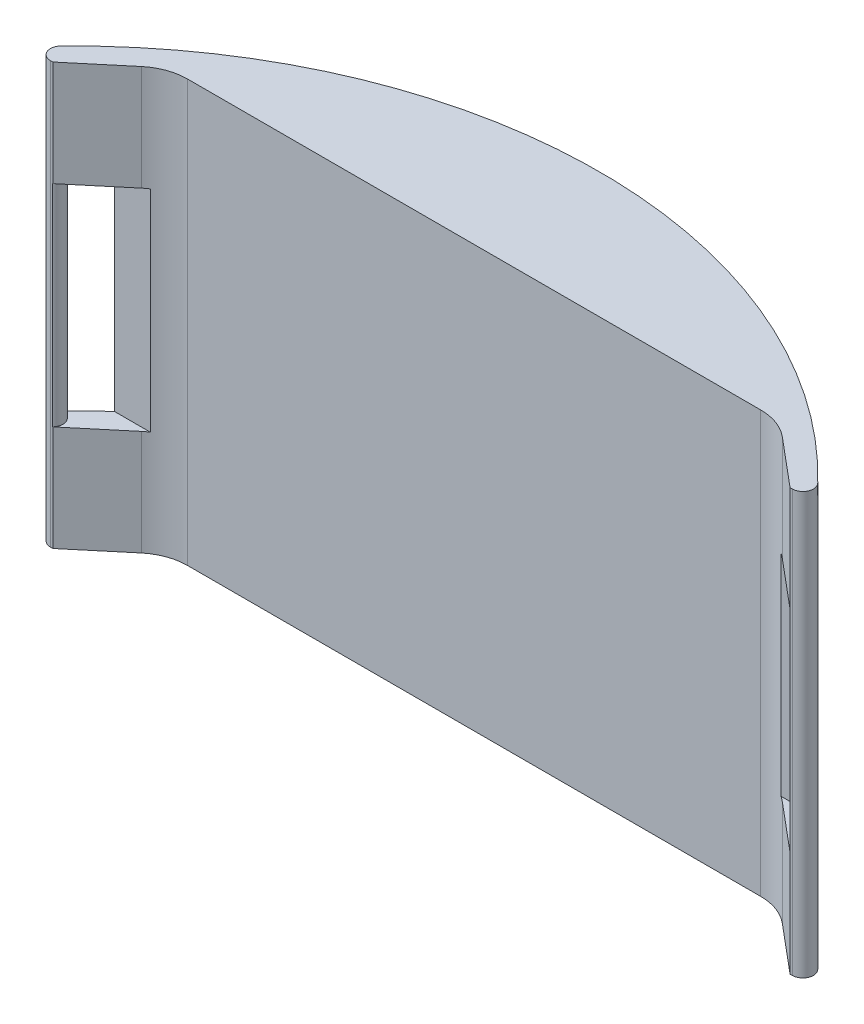
ISO-10303-21;
HEADER;
FILE_DESCRIPTION(('STEP AP214'),'2;1');
FILE_NAME('part.step','',(''),(''),'','','');
FILE_SCHEMA(('AUTOMOTIVE_DESIGN { 1 0 10303 214 1 1 1 1 }'));
ENDSEC;
DATA;
#1=APPLICATION_CONTEXT('core data for automotive mechanical design processes');
#2=APPLICATION_PROTOCOL_DEFINITION('international standard','automotive_design',2000,#1);
#3=PRODUCT_CONTEXT('',#1,'mechanical');
#4=PRODUCT('Part','Part','',(#3));
#5=PRODUCT_RELATED_PRODUCT_CATEGORY('part','',(#4));
#6=PRODUCT_DEFINITION_FORMATION('','',#4);
#7=PRODUCT_DEFINITION_CONTEXT('part definition',#1,'design');
#8=PRODUCT_DEFINITION('design','',#6,#7);
#9=PRODUCT_DEFINITION_SHAPE('','',#8);
#10=(LENGTH_UNIT() NAMED_UNIT(*) SI_UNIT(.MILLI.,.METRE.));
#11=(NAMED_UNIT(*) PLANE_ANGLE_UNIT() SI_UNIT($,.RADIAN.));
#12=(NAMED_UNIT(*) SI_UNIT($,.STERADIAN.) SOLID_ANGLE_UNIT());
#13=UNCERTAINTY_MEASURE_WITH_UNIT(LENGTH_MEASURE(1.E-05),#10,'distance_accuracy_value','');
#14=(GEOMETRIC_REPRESENTATION_CONTEXT(3) GLOBAL_UNCERTAINTY_ASSIGNED_CONTEXT((#13)) GLOBAL_UNIT_ASSIGNED_CONTEXT((#10,
#11,#12)) REPRESENTATION_CONTEXT('',''));
#15=CARTESIAN_POINT('',(0.,0.,0.));
#16=DIRECTION('',(0.,0.,1.));
#17=DIRECTION('',(1.,0.,0.));
#18=AXIS2_PLACEMENT_3D('',#15,#16,#17);
#19=CARTESIAN_POINT('',(86.5691753437898,0.,54.9576637500718));
#20=DIRECTION('',(0.642281467934558,0.,-0.766468861694869));
#21=DIRECTION('',(-0.766468861694869,0.,-0.642281467934558));
#22=AXIS2_PLACEMENT_3D('',#19,#20,#21);
#23=PLANE('',#22);
#24=DIRECTION('',(0.,1.,0.));
#25=VECTOR('',#24,1.);
#26=CARTESIAN_POINT('',(86.5691753437898,0.,54.9576637500718));
#27=LINE('',#26,#25);
#28=CARTESIAN_POINT('',(86.5691753437898,0.,54.9576637500718));
#29=VERTEX_POINT('',#28);
#30=CARTESIAN_POINT('',(86.5691753437898,20.,54.9576637500718));
#31=VERTEX_POINT('',#30);
#32=EDGE_CURVE('E399',#29,#31,#27,.T.);
#33=ORIENTED_EDGE('',*,*,#32,.T.);
#34=DIRECTION('',(-0.766468861694869,0.,-0.642281467934559));
#35=VECTOR('',#34,1.);
#36=CARTESIAN_POINT('',(86.5691753437898,20.,54.9576637500718));
#37=LINE('',#36,#35);
#38=CARTESIAN_POINT('',(77.4224920705355,20.,47.2929751331231));
#39=VERTEX_POINT('',#38);
#40=EDGE_CURVE('E304',#31,#39,#37,.T.);
#41=ORIENTED_EDGE('',*,*,#40,.T.);
#42=DIRECTION('',(0.,1.,0.));
#43=VECTOR('',#42,1.);
#44=CARTESIAN_POINT('',(77.4224920705355,0.,47.2929751331231));
#45=LINE('',#44,#43);
#46=CARTESIAN_POINT('',(77.4224920705355,0.,47.2929751331232));
#47=VERTEX_POINT('',#46);
#48=EDGE_CURVE('E395',#47,#39,#45,.T.);
#49=ORIENTED_EDGE('',*,*,#48,.F.);
#50=DIRECTION('',(-0.766468861694869,0.,-0.642281467934558));
#51=VECTOR('',#50,1.);
#52=CARTESIAN_POINT('',(86.5691753437898,0.,54.9576637500718));
#53=LINE('',#52,#51);
#54=EDGE_CURVE('E352',#29,#47,#53,.T.);
#55=ORIENTED_EDGE('',*,*,#54,.F.);
#56=EDGE_LOOP('',(#33,#41,#49,#55));
#57=FACE_BOUND('',#56,.T.);
#58=ADVANCED_FACE('F36',(#57),#23,.F.);
#59=CARTESIAN_POINT('',(-53.4308246562102,0.,54.9576637500718));
#60=DIRECTION('',(-0.642281467934558,0.,-0.76646886169487));
#61=DIRECTION('',(-0.76646886169487,0.,0.642281467934558));
#62=AXIS2_PLACEMENT_3D('',#59,#60,#61);
#63=PLANE('',#62);
#64=DIRECTION('',(0.,1.,0.));
#65=VECTOR('',#64,1.);
#66=CARTESIAN_POINT('',(-53.4308246562102,0.,54.9576637500718));
#67=LINE('',#66,#65);
#68=CARTESIAN_POINT('',(-53.4308246562102,60.,54.9576637500718));
#69=VERTEX_POINT('',#68);
#70=CARTESIAN_POINT('',(-53.4308246562102,80.,54.9576637500718));
#71=VERTEX_POINT('',#70);
#72=EDGE_CURVE('E386',#69,#71,#67,.T.);
#73=ORIENTED_EDGE('',*,*,#72,.F.);
#74=DIRECTION('',(0.76646886169487,0.,-0.642281467934558));
#75=VECTOR('',#74,1.);
#76=CARTESIAN_POINT('',(-53.4308246562102,60.,54.9576637500718));
#77=LINE('',#76,#75);
#78=CARTESIAN_POINT('',(-44.2841413829558,60.,47.2929751331232));
#79=VERTEX_POINT('',#78);
#80=EDGE_CURVE('E330',#69,#79,#77,.T.);
#81=ORIENTED_EDGE('',*,*,#80,.T.);
#82=DIRECTION('',(0.,1.,0.));
#83=VECTOR('',#82,1.);
#84=CARTESIAN_POINT('',(-44.2841413829558,0.,47.2929751331232));
#85=LINE('',#84,#83);
#86=CARTESIAN_POINT('',(-44.2841413829558,80.,47.2929751331232));
#87=VERTEX_POINT('',#86);
#88=EDGE_CURVE('E390',#79,#87,#85,.T.);
#89=ORIENTED_EDGE('',*,*,#88,.T.);
#90=DIRECTION('',(-0.76646886169487,0.,0.642281467934558));
#91=VECTOR('',#90,1.);
#92=CARTESIAN_POINT('',(-53.4308246562102,80.,54.9576637500718));
#93=LINE('',#92,#91);
#94=EDGE_CURVE('E356',#87,#71,#93,.T.);
#95=ORIENTED_EDGE('',*,*,#94,.T.);
#96=EDGE_LOOP('',(#73,#81,#89,#95));
#97=FACE_BOUND('',#96,.T.);
#98=ADVANCED_FACE('F468',(#97),#63,.F.);
#99=CARTESIAN_POINT('',(-58.4308246562102,80.,54.9576637500718));
#100=DIRECTION('',(0.,0.,-1.));
#101=DIRECTION('',(-1.,0.,0.));
#102=AXIS2_PLACEMENT_3D('',#99,#100,#101);
#103=PLANE('',#102);
#104=DIRECTION('',(0.,1.,0.));
#105=VECTOR('',#104,1.);
#106=CARTESIAN_POINT('',(-53.4477873493992,40.,54.9576637500718));
#107=LINE('',#106,#105);
#108=CARTESIAN_POINT('',(-53.4477873493992,20.,54.9576637500718));
#109=VERTEX_POINT('',#108);
#110=CARTESIAN_POINT('',(-53.4477873493992,60.,54.9576637500718));
#111=VERTEX_POINT('',#110);
#112=EDGE_CURVE('E272',#109,#111,#107,.T.);
#113=ORIENTED_EDGE('',*,*,#112,.T.);
#114=DIRECTION('',(1.,0.,0.));
#115=VECTOR('',#114,1.);
#116=CARTESIAN_POINT('',(-58.4308246562102,60.,54.9576637500718));
#117=LINE('',#116,#115);
#118=EDGE_CURVE('E275',#111,#69,#117,.T.);
#119=ORIENTED_EDGE('',*,*,#118,.T.);
#120=ORIENTED_EDGE('',*,*,#72,.T.);
#121=DIRECTION('',(1.,0.,0.));
#122=VECTOR('',#121,1.);
#123=CARTESIAN_POINT('',(-58.4308246562102,80.,54.9576637500718));
#124=LINE('',#123,#122);
#125=CARTESIAN_POINT('',(-53.8611084047053,80.,54.9576637500718));
#126=VERTEX_POINT('',#125);
#127=EDGE_CURVE('E402',#126,#71,#124,.T.);
#128=ORIENTED_EDGE('',*,*,#127,.F.);
#129=DIRECTION('',(0.,-1.,0.));
#130=VECTOR('',#129,1.);
#131=CARTESIAN_POINT('',(-53.8611084047053,80.,54.9576637500718));
#132=LINE('',#131,#130);
#133=CARTESIAN_POINT('',(-53.8611084047053,0.,54.9576637500718));
#134=VERTEX_POINT('',#133);
#135=EDGE_CURVE('E409',#126,#134,#132,.T.);
#136=ORIENTED_EDGE('',*,*,#135,.T.);
#137=DIRECTION('',(1.,0.,0.));
#138=VECTOR('',#137,1.);
#139=CARTESIAN_POINT('',(-58.4308246562102,0.,54.9576637500718));
#140=LINE('',#139,#138);
#141=CARTESIAN_POINT('',(-53.4308246562102,0.,54.9576637500718));
#142=VERTEX_POINT('',#141);
#143=EDGE_CURVE('E410',#134,#142,#140,.T.);
#144=ORIENTED_EDGE('',*,*,#143,.T.);
#145=CARTESIAN_POINT('',(-53.4308246562102,20.,54.9576637500718));
#146=VERTEX_POINT('',#145);
#147=EDGE_CURVE('E382',#142,#146,#67,.T.);
#148=ORIENTED_EDGE('',*,*,#147,.T.);
#149=DIRECTION('',(-1.,0.,0.));
#150=VECTOR('',#149,1.);
#151=CARTESIAN_POINT('',(-58.4308246562102,20.,54.9576637500718));
#152=LINE('',#151,#150);
#153=EDGE_CURVE('E269',#146,#109,#152,.T.);
#154=ORIENTED_EDGE('',*,*,#153,.T.);
#155=EDGE_LOOP('',(#113,#119,#120,#128,#136,#144,#148,#154));
#156=FACE_BOUND('',#155,.T.);
#157=ADVANCED_FACE('F434',(#156),#103,.F.);
#158=DIRECTION('',(0.,-1.,0.));
#159=VECTOR('',#158,1.);
#160=CARTESIAN_POINT('',(86.5861380369788,40.,54.9576637500718));
#161=LINE('',#160,#159);
#162=CARTESIAN_POINT('',(86.5861380369788,60.,54.9576637500718));
#163=VERTEX_POINT('',#162);
#164=CARTESIAN_POINT('',(86.5861380369788,20.,54.9576637500718));
#165=VERTEX_POINT('',#164);
#166=EDGE_CURVE('E288',#163,#165,#161,.T.);
#167=ORIENTED_EDGE('',*,*,#166,.T.);
#168=DIRECTION('',(-1.,0.,0.));
#169=VECTOR('',#168,1.);
#170=CARTESIAN_POINT('',(-58.4308246562102,20.,54.9576637500718));
#171=LINE('',#170,#169);
#172=EDGE_CURVE('E291',#165,#31,#171,.T.);
#173=ORIENTED_EDGE('',*,*,#172,.T.);
#174=ORIENTED_EDGE('',*,*,#32,.F.);
#175=CARTESIAN_POINT('',(86.999459092285,0.,54.9576637500718));
#176=VERTEX_POINT('',#175);
#177=EDGE_CURVE('E385',#29,#176,#140,.T.);
#178=ORIENTED_EDGE('',*,*,#177,.T.);
#179=DIRECTION('',(0.,-1.,0.));
#180=VECTOR('',#179,1.);
#181=CARTESIAN_POINT('',(86.999459092285,80.,54.9576637500718));
#182=LINE('',#181,#180);
#183=CARTESIAN_POINT('',(86.999459092285,80.,54.9576637500718));
#184=VERTEX_POINT('',#183);
#185=EDGE_CURVE('E247',#176,#184,#182,.F.);
#186=ORIENTED_EDGE('',*,*,#185,.T.);
#187=CARTESIAN_POINT('',(86.5691753437898,80.,54.9576637500718));
#188=VERTEX_POINT('',#187);
#189=EDGE_CURVE('E406',#188,#184,#124,.T.);
#190=ORIENTED_EDGE('',*,*,#189,.F.);
#191=CARTESIAN_POINT('',(86.5691753437898,60.,54.9576637500718));
#192=VERTEX_POINT('',#191);
#193=EDGE_CURVE('E368',#192,#188,#27,.T.);
#194=ORIENTED_EDGE('',*,*,#193,.F.);
#195=DIRECTION('',(1.,0.,0.));
#196=VECTOR('',#195,1.);
#197=CARTESIAN_POINT('',(-58.4308246562102,60.,54.9576637500718));
#198=LINE('',#197,#196);
#199=EDGE_CURVE('E285',#192,#163,#198,.T.);
#200=ORIENTED_EDGE('',*,*,#199,.T.);
#201=EDGE_LOOP('',(#167,#173,#174,#178,#186,#190,#194,#200));
#202=FACE_BOUND('',#201,.T.);
#203=ADVANCED_FACE('F481',(#202),#103,.F.);
#204=CARTESIAN_POINT('',(16.5691753437898,80.,121.101446526687));
#205=DIRECTION('',(0.,-1.,0.));
#206=DIRECTION('',(0.,0.,-1.));
#207=AXIS2_PLACEMENT_3D('',#204,#205,#206);
#208=CYLINDRICAL_SURFACE('',#207,100.);
#209=DIRECTION('',(0.,-1.,0.));
#210=VECTOR('',#209,1.);
#211=CARTESIAN_POINT('',(67.3554794910244,80.,34.9576637500719));
#212=LINE('',#211,#210);
#213=CARTESIAN_POINT('',(67.3554794910243,20.,34.9576637500719));
#214=VERTEX_POINT('',#213);
#215=CARTESIAN_POINT('',(67.3554794910243,60.,34.9576637500719));
#216=VERTEX_POINT('',#215);
#217=EDGE_CURVE('E257',#214,#216,#212,.F.);
#218=ORIENTED_EDGE('',*,*,#217,.T.);
#219=CARTESIAN_POINT('',(16.5691753437898,60.,121.101446526687));
#220=DIRECTION('',(0.,1.,0.));
#221=DIRECTION('',(0.,0.,1.));
#222=AXIS2_PLACEMENT_3D('',#219,#220,#221);
#223=CIRCLE('',#222,100.);
#224=CARTESIAN_POINT('',(-34.2171288034447,60.,34.9576637500719));
#225=VERTEX_POINT('',#224);
#226=EDGE_CURVE('E263',#216,#225,#223,.T.);
#227=ORIENTED_EDGE('',*,*,#226,.T.);
#228=DIRECTION('',(0.,-1.,0.));
#229=VECTOR('',#228,1.);
#230=CARTESIAN_POINT('',(-34.2171288034447,80.,34.9576637500719));
#231=LINE('',#230,#229);
#232=CARTESIAN_POINT('',(-34.2171288034447,20.,34.9576637500719));
#233=VERTEX_POINT('',#232);
#234=EDGE_CURVE('E260',#225,#233,#231,.T.);
#235=ORIENTED_EDGE('',*,*,#234,.T.);
#236=CARTESIAN_POINT('',(16.5691753437898,20.,121.101446526687));
#237=DIRECTION('',(0.,-1.,0.));
#238=DIRECTION('',(0.,0.,-1.));
#239=AXIS2_PLACEMENT_3D('',#236,#237,#238);
#240=CIRCLE('',#239,100.);
#241=EDGE_CURVE('E255',#233,#214,#240,.T.);
#242=ORIENTED_EDGE('',*,*,#241,.T.);
#243=EDGE_LOOP('',(#218,#227,#235,#242));
#244=FACE_BOUND('',#243,.T.);
#245=DIRECTION('',(0.,-1.,0.));
#246=VECTOR('',#245,1.);
#247=CARTESIAN_POINT('',(88.4368118218461,80.,51.5669743056511));
#248=LINE('',#247,#246);
#249=CARTESIAN_POINT('',(88.4368118218461,80.,51.5669743056511));
#250=VERTEX_POINT('',#249);
#251=CARTESIAN_POINT('',(88.4368118218461,60.,51.5669743056511));
#252=VERTEX_POINT('',#251);
#253=EDGE_CURVE('E226',#250,#252,#248,.T.);
#254=ORIENTED_EDGE('',*,*,#253,.T.);
#255=CARTESIAN_POINT('',(16.5691753437898,60.,121.101446526687));
#256=DIRECTION('',(0.,1.,0.));
#257=DIRECTION('',(0.,0.,1.));
#258=AXIS2_PLACEMENT_3D('',#255,#256,#257);
#259=CIRCLE('',#258,100.);
#260=CARTESIAN_POINT('',(83.2371020457031,60.,46.5669743056511));
#261=VERTEX_POINT('',#260);
#262=EDGE_CURVE('E299',#252,#261,#259,.T.);
#263=ORIENTED_EDGE('',*,*,#262,.T.);
#264=DIRECTION('',(0.,-1.,0.));
#265=VECTOR('',#264,1.);
#266=CARTESIAN_POINT('',(83.2371020457032,80.,46.5669743056511));
#267=LINE('',#266,#265);
#268=CARTESIAN_POINT('',(83.2371020457032,20.,46.5669743056511));
#269=VERTEX_POINT('',#268);
#270=EDGE_CURVE('E234',#261,#269,#267,.T.);
#271=ORIENTED_EDGE('',*,*,#270,.T.);
#272=CARTESIAN_POINT('',(16.5691753437898,20.,121.101446526687));
#273=DIRECTION('',(0.,-1.,0.));
#274=DIRECTION('',(0.,0.,-1.));
#275=AXIS2_PLACEMENT_3D('',#272,#273,#274);
#276=CIRCLE('',#275,100.);
#277=CARTESIAN_POINT('',(88.4368118218461,20.,51.5669743056511));
#278=VERTEX_POINT('',#277);
#279=EDGE_CURVE('E209',#269,#278,#276,.T.);
#280=ORIENTED_EDGE('',*,*,#279,.T.);
#281=CARTESIAN_POINT('',(88.4368118218461,0.,51.5669743056511));
#282=VERTEX_POINT('',#281);
#283=EDGE_CURVE('E227',#278,#282,#248,.T.);
#284=ORIENTED_EDGE('',*,*,#283,.T.);
#285=CARTESIAN_POINT('',(16.5691753437898,0.,121.101446526687));
#286=DIRECTION('',(0.,1.,0.));
#287=DIRECTION('',(0.,0.,1.));
#288=AXIS2_PLACEMENT_3D('',#285,#286,#287);
#289=CIRCLE('',#288,100.);
#290=CARTESIAN_POINT('',(-55.2984611342665,0.,51.5669743056511));
#291=VERTEX_POINT('',#290);
#292=EDGE_CURVE('E412',#282,#291,#289,.T.);
#293=ORIENTED_EDGE('',*,*,#292,.T.);
#294=DIRECTION('',(0.,-1.,0.));
#295=VECTOR('',#294,1.);
#296=CARTESIAN_POINT('',(-55.2984611342665,80.,51.5669743056511));
#297=LINE('',#296,#295);
#298=CARTESIAN_POINT('',(-55.2984611342665,20.,51.5669743056511));
#299=VERTEX_POINT('',#298);
#300=EDGE_CURVE('E243',#291,#299,#297,.F.);
#301=ORIENTED_EDGE('',*,*,#300,.T.);
#302=CARTESIAN_POINT('',(-50.0987513581236,20.,46.5669743056511));
#303=VERTEX_POINT('',#302);
#304=EDGE_CURVE('E235',#299,#303,#276,.T.);
#305=ORIENTED_EDGE('',*,*,#304,.T.);
#306=DIRECTION('',(0.,-1.,0.));
#307=VECTOR('',#306,1.);
#308=CARTESIAN_POINT('',(-50.0987513581236,80.,46.5669743056511));
#309=LINE('',#308,#307);
#310=CARTESIAN_POINT('',(-50.0987513581236,60.,46.5669743056511));
#311=VERTEX_POINT('',#310);
#312=EDGE_CURVE('E341',#303,#311,#309,.F.);
#313=ORIENTED_EDGE('',*,*,#312,.T.);
#314=CARTESIAN_POINT('',(-55.2984611342665,60.,51.5669743056511));
#315=VERTEX_POINT('',#314);
#316=EDGE_CURVE('E333',#311,#315,#259,.T.);
#317=ORIENTED_EDGE('',*,*,#316,.T.);
#318=CARTESIAN_POINT('',(-55.2984611342665,80.,51.5669743056511));
#319=VERTEX_POINT('',#318);
#320=EDGE_CURVE('E419',#315,#319,#297,.F.);
#321=ORIENTED_EDGE('',*,*,#320,.T.);
#322=CARTESIAN_POINT('',(16.5691753437898,80.,121.101446526687));
#323=DIRECTION('',(0.,1.,0.));
#324=DIRECTION('',(0.,0.,1.));
#325=AXIS2_PLACEMENT_3D('',#322,#323,#324);
#326=CIRCLE('',#325,100.);
#327=EDGE_CURVE('E405',#250,#319,#326,.T.);
#328=ORIENTED_EDGE('',*,*,#327,.F.);
#329=EDGE_LOOP('',(#254,#263,#271,#280,#284,#293,#301,#305,#313,#317,#321,#328));
#330=FACE_BOUND('',#329,.T.);
#331=ADVANCED_FACE('F231',(#244,#330),#208,.T.);
#332=CARTESIAN_POINT('',(16.5691753437898,80.,121.101446526687));
#333=DIRECTION('',(0.,1.,0.));
#334=DIRECTION('',(0.,0.,1.));
#335=AXIS2_PLACEMENT_3D('',#332,#333,#334);
#336=PLANE('',#335);
#337=ORIENTED_EDGE('',*,*,#189,.T.);
#338=CARTESIAN_POINT('',(86.999459092285,80.,52.9576637500718));
#339=DIRECTION('',(0.,1.,0.));
#340=DIRECTION('',(0.,0.,1.));
#341=AXIS2_PLACEMENT_3D('',#338,#339,#340);
#342=CIRCLE('',#341,2.);
#343=EDGE_CURVE('E251',#184,#250,#342,.T.);
#344=ORIENTED_EDGE('',*,*,#343,.T.);
#345=ORIENTED_EDGE('',*,*,#327,.T.);
#346=CARTESIAN_POINT('',(-53.8611084047053,80.,52.9576637500718));
#347=DIRECTION('',(0.,1.,0.));
#348=DIRECTION('',(0.,0.,1.));
#349=AXIS2_PLACEMENT_3D('',#346,#347,#348);
#350=CIRCLE('',#349,2.);
#351=EDGE_CURVE('E242',#319,#126,#350,.T.);
#352=ORIENTED_EDGE('',*,*,#351,.T.);
#353=ORIENTED_EDGE('',*,*,#127,.T.);
#354=ORIENTED_EDGE('',*,*,#94,.F.);
#355=CARTESIAN_POINT('',(-37.8613267036102,80.,54.9576637500718));
#356=DIRECTION('',(0.,1.,0.));
#357=DIRECTION('',(0.,0.,-1.));
#358=AXIS2_PLACEMENT_3D('',#355,#356,#357);
#359=CIRCLE('',#358,10.);
#360=CARTESIAN_POINT('',(-37.8613267036102,80.,44.9576637500718));
#361=VERTEX_POINT('',#360);
#362=EDGE_CURVE('E377',#361,#87,#359,.T.);
#363=ORIENTED_EDGE('',*,*,#362,.F.);
#364=DIRECTION('',(-1.,0.,0.));
#365=VECTOR('',#364,1.);
#366=CARTESIAN_POINT('',(16.5691753437898,80.,44.9576637500718));
#367=LINE('',#366,#365);
#368=CARTESIAN_POINT('',(70.9996773911898,80.,44.9576637500718));
#369=VERTEX_POINT('',#368);
#370=EDGE_CURVE('E374',#369,#361,#367,.T.);
#371=ORIENTED_EDGE('',*,*,#370,.F.);
#372=CARTESIAN_POINT('',(70.9996773911898,80.,54.9576637500718));
#373=DIRECTION('',(0.,1.,0.));
#374=DIRECTION('',(0.,0.,-1.));
#375=AXIS2_PLACEMENT_3D('',#372,#373,#374);
#376=CIRCLE('',#375,10.);
#377=CARTESIAN_POINT('',(77.4224920705355,80.,47.2929751331231));
#378=VERTEX_POINT('',#377);
#379=EDGE_CURVE('E371',#378,#369,#376,.T.);
#380=ORIENTED_EDGE('',*,*,#379,.F.);
#381=DIRECTION('',(-0.766468861694869,0.,-0.642281467934558));
#382=VECTOR('',#381,1.);
#383=CARTESIAN_POINT('',(86.5691753437898,80.,54.9576637500718));
#384=LINE('',#383,#382);
#385=EDGE_CURVE('E349',#188,#378,#384,.T.);
#386=ORIENTED_EDGE('',*,*,#385,.F.);
#387=EDGE_LOOP('',(#337,#344,#345,#352,#353,#354,#363,#371,#380,#386));
#388=FACE_BOUND('',#387,.T.);
#389=ADVANCED_FACE('F428',(#388),#336,.T.);
#390=CARTESIAN_POINT('',(16.5691753437898,0.,121.101446526687));
#391=DIRECTION('',(0.,1.,0.));
#392=DIRECTION('',(0.,0.,1.));
#393=AXIS2_PLACEMENT_3D('',#390,#391,#392);
#394=PLANE('',#393);
#395=ORIENTED_EDGE('',*,*,#292,.F.);
#396=CARTESIAN_POINT('',(86.999459092285,0.,52.9576637500718));
#397=DIRECTION('',(0.,1.,0.));
#398=DIRECTION('',(0.,0.,1.));
#399=AXIS2_PLACEMENT_3D('',#396,#397,#398);
#400=CIRCLE('',#399,2.);
#401=EDGE_CURVE('E240',#282,#176,#400,.F.);
#402=ORIENTED_EDGE('',*,*,#401,.T.);
#403=ORIENTED_EDGE('',*,*,#177,.F.);
#404=ORIENTED_EDGE('',*,*,#54,.T.);
#405=CARTESIAN_POINT('',(70.9996773911898,0.,54.9576637500718));
#406=DIRECTION('',(0.,1.,0.));
#407=DIRECTION('',(0.,0.,-1.));
#408=AXIS2_PLACEMENT_3D('',#405,#406,#407);
#409=CIRCLE('',#408,10.);
#410=CARTESIAN_POINT('',(70.9996773911898,0.,44.9576637500718));
#411=VERTEX_POINT('',#410);
#412=EDGE_CURVE('E355',#47,#411,#409,.T.);
#413=ORIENTED_EDGE('',*,*,#412,.T.);
#414=DIRECTION('',(-1.,0.,0.));
#415=VECTOR('',#414,1.);
#416=CARTESIAN_POINT('',(16.5691753437898,0.,44.9576637500718));
#417=LINE('',#416,#415);
#418=CARTESIAN_POINT('',(-37.8613267036102,0.,44.9576637500718));
#419=VERTEX_POINT('',#418);
#420=EDGE_CURVE('E359',#411,#419,#417,.T.);
#421=ORIENTED_EDGE('',*,*,#420,.T.);
#422=CARTESIAN_POINT('',(-37.8613267036102,0.,54.9576637500718));
#423=DIRECTION('',(0.,1.,0.));
#424=DIRECTION('',(0.,0.,-1.));
#425=AXIS2_PLACEMENT_3D('',#422,#423,#424);
#426=CIRCLE('',#425,10.);
#427=CARTESIAN_POINT('',(-44.2841413829558,0.,47.2929751331232));
#428=VERTEX_POINT('',#427);
#429=EDGE_CURVE('E362',#419,#428,#426,.T.);
#430=ORIENTED_EDGE('',*,*,#429,.T.);
#431=DIRECTION('',(-0.76646886169487,0.,0.642281467934558));
#432=VECTOR('',#431,1.);
#433=CARTESIAN_POINT('',(-53.4308246562102,0.,54.9576637500718));
#434=LINE('',#433,#432);
#435=EDGE_CURVE('E365',#428,#142,#434,.T.);
#436=ORIENTED_EDGE('',*,*,#435,.T.);
#437=ORIENTED_EDGE('',*,*,#143,.F.);
#438=CARTESIAN_POINT('',(-53.8611084047053,0.,52.9576637500718));
#439=DIRECTION('',(0.,1.,0.));
#440=DIRECTION('',(0.,0.,1.));
#441=AXIS2_PLACEMENT_3D('',#438,#439,#440);
#442=CIRCLE('',#441,2.);
#443=EDGE_CURVE('E416',#134,#291,#442,.F.);
#444=ORIENTED_EDGE('',*,*,#443,.T.);
#445=EDGE_LOOP('',(#395,#402,#403,#404,#413,#421,#430,#436,#437,#444));
#446=FACE_BOUND('',#445,.T.);
#447=ADVANCED_FACE('F436',(#446),#394,.F.);
#448=DIRECTION('',(-0.76646886169487,0.,0.642281467934558));
#449=VECTOR('',#448,1.);
#450=CARTESIAN_POINT('',(-53.4308246562102,20.,54.9576637500718));
#451=LINE('',#450,#449);
#452=CARTESIAN_POINT('',(-44.2841413829558,20.,47.2929751331232));
#453=VERTEX_POINT('',#452);
#454=EDGE_CURVE('E320',#453,#146,#451,.T.);
#455=ORIENTED_EDGE('',*,*,#454,.T.);
#456=ORIENTED_EDGE('',*,*,#147,.F.);
#457=ORIENTED_EDGE('',*,*,#435,.F.);
#458=EDGE_CURVE('E387',#428,#453,#85,.T.);
#459=ORIENTED_EDGE('',*,*,#458,.T.);
#460=EDGE_LOOP('',(#455,#456,#457,#459));
#461=FACE_BOUND('',#460,.T.);
#462=ADVANCED_FACE('F440',(#461),#63,.F.);
#463=CARTESIAN_POINT('',(-37.8613267036102,0.,54.9576637500718));
#464=DIRECTION('',(0.,1.,0.));
#465=DIRECTION('',(0.,0.,1.));
#466=AXIS2_PLACEMENT_3D('',#463,#464,#465);
#467=CYLINDRICAL_SURFACE('',#466,10.);
#468=ORIENTED_EDGE('',*,*,#88,.F.);
#469=CARTESIAN_POINT('',(-37.8613267036102,60.,54.9576637500718));
#470=DIRECTION('',(0.,1.,0.));
#471=DIRECTION('',(0.,0.,1.));
#472=AXIS2_PLACEMENT_3D('',#469,#470,#471);
#473=CIRCLE('',#472,10.);
#474=CARTESIAN_POINT('',(-43.3015776764319,60.,46.5669743056511));
#475=VERTEX_POINT('',#474);
#476=EDGE_CURVE('E327',#79,#475,#473,.F.);
#477=ORIENTED_EDGE('',*,*,#476,.T.);
#478=DIRECTION('',(0.,1.,0.));
#479=VECTOR('',#478,1.);
#480=CARTESIAN_POINT('',(-43.3015776764319,0.,46.5669743056511));
#481=LINE('',#480,#479);
#482=CARTESIAN_POINT('',(-43.3015776764319,20.,46.5669743056511));
#483=VERTEX_POINT('',#482);
#484=EDGE_CURVE('E338',#475,#483,#481,.F.);
#485=ORIENTED_EDGE('',*,*,#484,.T.);
#486=CARTESIAN_POINT('',(-37.8613267036102,20.,54.9576637500718));
#487=DIRECTION('',(0.,-1.,0.));
#488=DIRECTION('',(0.,0.,-1.));
#489=AXIS2_PLACEMENT_3D('',#486,#487,#488);
#490=CIRCLE('',#489,10.);
#491=EDGE_CURVE('E317',#483,#453,#490,.F.);
#492=ORIENTED_EDGE('',*,*,#491,.T.);
#493=ORIENTED_EDGE('',*,*,#458,.F.);
#494=ORIENTED_EDGE('',*,*,#429,.F.);
#495=DIRECTION('',(0.,1.,0.));
#496=VECTOR('',#495,1.);
#497=CARTESIAN_POINT('',(-37.8613267036102,0.,44.9576637500718));
#498=LINE('',#497,#496);
#499=EDGE_CURVE('E391',#419,#361,#498,.T.);
#500=ORIENTED_EDGE('',*,*,#499,.T.);
#501=ORIENTED_EDGE('',*,*,#362,.T.);
#502=EDGE_LOOP('',(#468,#477,#485,#492,#493,#494,#500,#501));
#503=FACE_BOUND('',#502,.T.);
#504=ADVANCED_FACE('F463',(#503),#467,.F.);
#505=CARTESIAN_POINT('',(16.5691753437898,0.,44.9576637500718));
#506=DIRECTION('',(0.,0.,-1.));
#507=DIRECTION('',(-1.,0.,0.));
#508=AXIS2_PLACEMENT_3D('',#505,#506,#507);
#509=PLANE('',#508);
#510=ORIENTED_EDGE('',*,*,#370,.T.);
#511=ORIENTED_EDGE('',*,*,#499,.F.);
#512=ORIENTED_EDGE('',*,*,#420,.F.);
#513=DIRECTION('',(0.,1.,0.));
#514=VECTOR('',#513,1.);
#515=CARTESIAN_POINT('',(70.9996773911898,0.,44.9576637500718));
#516=LINE('',#515,#514);
#517=EDGE_CURVE('E393',#411,#369,#516,.T.);
#518=ORIENTED_EDGE('',*,*,#517,.T.);
#519=EDGE_LOOP('',(#510,#511,#512,#518));
#520=FACE_BOUND('',#519,.T.);
#521=ADVANCED_FACE('F473',(#520),#509,.F.);
#522=CARTESIAN_POINT('',(70.9996773911898,0.,54.9576637500718));
#523=DIRECTION('',(0.,1.,0.));
#524=DIRECTION('',(0.,0.,1.));
#525=AXIS2_PLACEMENT_3D('',#522,#523,#524);
#526=CYLINDRICAL_SURFACE('',#525,10.);
#527=DIRECTION('',(0.,1.,0.));
#528=VECTOR('',#527,1.);
#529=CARTESIAN_POINT('',(76.4399283640115,0.,46.5669743056511));
#530=LINE('',#529,#528);
#531=CARTESIAN_POINT('',(76.4399283640115,20.,46.5669743056511));
#532=VERTEX_POINT('',#531);
#533=CARTESIAN_POINT('',(76.4399283640115,60.,46.5669743056511));
#534=VERTEX_POINT('',#533);
#535=EDGE_CURVE('E266',#532,#534,#530,.T.);
#536=ORIENTED_EDGE('',*,*,#535,.T.);
#537=CARTESIAN_POINT('',(70.9996773911898,60.,54.9576637500718));
#538=DIRECTION('',(0.,1.,0.));
#539=DIRECTION('',(0.,0.,1.));
#540=AXIS2_PLACEMENT_3D('',#537,#538,#539);
#541=CIRCLE('',#540,10.);
#542=CARTESIAN_POINT('',(77.4224920705355,60.,47.2929751331232));
#543=VERTEX_POINT('',#542);
#544=EDGE_CURVE('E324',#534,#543,#541,.F.);
#545=ORIENTED_EDGE('',*,*,#544,.T.);
#546=EDGE_CURVE('E398',#543,#378,#45,.T.);
#547=ORIENTED_EDGE('',*,*,#546,.T.);
#548=ORIENTED_EDGE('',*,*,#379,.T.);
#549=ORIENTED_EDGE('',*,*,#517,.F.);
#550=ORIENTED_EDGE('',*,*,#412,.F.);
#551=ORIENTED_EDGE('',*,*,#48,.T.);
#552=CARTESIAN_POINT('',(70.9996773911898,20.,54.9576637500718));
#553=DIRECTION('',(0.,-1.,0.));
#554=DIRECTION('',(0.,0.,-1.));
#555=AXIS2_PLACEMENT_3D('',#552,#553,#554);
#556=CIRCLE('',#555,10.);
#557=EDGE_CURVE('E314',#39,#532,#556,.F.);
#558=ORIENTED_EDGE('',*,*,#557,.T.);
#559=EDGE_LOOP('',(#536,#545,#547,#548,#549,#550,#551,#558));
#560=FACE_BOUND('',#559,.T.);
#561=ADVANCED_FACE('F476',(#560),#526,.F.);
#562=DIRECTION('',(0.766468861694869,0.,0.642281467934559));
#563=VECTOR('',#562,1.);
#564=CARTESIAN_POINT('',(86.5691753437898,60.,54.9576637500718));
#565=LINE('',#564,#563);
#566=EDGE_CURVE('E51',#543,#192,#565,.T.);
#567=ORIENTED_EDGE('',*,*,#566,.T.);
#568=ORIENTED_EDGE('',*,*,#193,.T.);
#569=ORIENTED_EDGE('',*,*,#385,.T.);
#570=ORIENTED_EDGE('',*,*,#546,.F.);
#571=EDGE_LOOP('',(#567,#568,#569,#570));
#572=FACE_BOUND('',#571,.T.);
#573=ADVANCED_FACE('F477',(#572),#23,.F.);
#574=CARTESIAN_POINT('',(-53.8611084047053,80.,52.9576637500718));
#575=DIRECTION('',(0.,-1.,0.));
#576=DIRECTION('',(0.,0.,-1.));
#577=AXIS2_PLACEMENT_3D('',#574,#575,#576);
#578=CYLINDRICAL_SURFACE('',#577,2.);
#579=ORIENTED_EDGE('',*,*,#351,.F.);
#580=ORIENTED_EDGE('',*,*,#320,.F.);
#581=DIRECTION('',(0.,-1.,0.));
#582=VECTOR('',#581,1.);
#583=CARTESIAN_POINT('',(-55.2984611342665,80.,51.5669743056511));
#584=LINE('',#583,#582);
#585=EDGE_CURVE('E336',#299,#315,#584,.F.);
#586=ORIENTED_EDGE('',*,*,#585,.F.);
#587=ORIENTED_EDGE('',*,*,#300,.F.);
#588=ORIENTED_EDGE('',*,*,#443,.F.);
#589=ORIENTED_EDGE('',*,*,#135,.F.);
#590=EDGE_LOOP('',(#579,#580,#586,#587,#588,#589));
#591=FACE_BOUND('',#590,.T.);
#592=ADVANCED_FACE('F431',(#591),#578,.T.);
#593=CARTESIAN_POINT('',(86.999459092285,80.,52.9576637500718));
#594=DIRECTION('',(0.,-1.,0.));
#595=DIRECTION('',(0.,0.,-1.));
#596=AXIS2_PLACEMENT_3D('',#593,#594,#595);
#597=CYLINDRICAL_SURFACE('',#596,2.);
#598=ORIENTED_EDGE('',*,*,#343,.F.);
#599=ORIENTED_EDGE('',*,*,#185,.F.);
#600=ORIENTED_EDGE('',*,*,#401,.F.);
#601=ORIENTED_EDGE('',*,*,#283,.F.);
#602=EDGE_CURVE('E217',#252,#278,#248,.T.);
#603=ORIENTED_EDGE('',*,*,#602,.F.);
#604=ORIENTED_EDGE('',*,*,#253,.F.);
#605=EDGE_LOOP('',(#598,#599,#600,#601,#603,#604));
#606=FACE_BOUND('',#605,.T.);
#607=ADVANCED_FACE('F238',(#606),#597,.T.);
#608=CARTESIAN_POINT('',(-90.,40.,34.9576637500718));
#609=DIRECTION('',(0.,0.,1.));
#610=DIRECTION('',(1.,0.,0.));
#611=AXIS2_PLACEMENT_3D('',#608,#609,#610);
#612=PLANE('',#611);
#613=DIRECTION('',(1.,0.,0.));
#614=VECTOR('',#613,1.);
#615=CARTESIAN_POINT('',(-90.,60.,34.9576637500718));
#616=LINE('',#615,#614);
#617=EDGE_CURVE('E346',#225,#216,#616,.T.);
#618=ORIENTED_EDGE('',*,*,#617,.T.);
#619=ORIENTED_EDGE('',*,*,#217,.F.);
#620=DIRECTION('',(1.,0.,0.));
#621=VECTOR('',#620,1.);
#622=CARTESIAN_POINT('',(-90.,20.,34.9576637500718));
#623=LINE('',#622,#621);
#624=EDGE_CURVE('E345',#233,#214,#623,.T.);
#625=ORIENTED_EDGE('',*,*,#624,.F.);
#626=ORIENTED_EDGE('',*,*,#234,.F.);
#627=EDGE_LOOP('',(#618,#619,#625,#626));
#628=FACE_BOUND('',#627,.T.);
#629=ADVANCED_FACE('F522',(#628),#612,.F.);
#630=CARTESIAN_POINT('',(-90.,60.,21.1014465266866));
#631=DIRECTION('',(0.,1.,0.));
#632=DIRECTION('',(0.,0.,1.));
#633=AXIS2_PLACEMENT_3D('',#630,#631,#632);
#634=PLANE('',#633);
#635=ORIENTED_EDGE('',*,*,#617,.F.);
#636=ORIENTED_EDGE('',*,*,#226,.F.);
#637=EDGE_LOOP('',(#635,#636));
#638=FACE_BOUND('',#637,.T.);
#639=ADVANCED_FACE('F518',(#638),#634,.F.);
#640=CARTESIAN_POINT('',(-90.,20.,34.9576637500718));
#641=DIRECTION('',(0.,-1.,0.));
#642=DIRECTION('',(0.,0.,-1.));
#643=AXIS2_PLACEMENT_3D('',#640,#641,#642);
#644=PLANE('',#643);
#645=ORIENTED_EDGE('',*,*,#241,.F.);
#646=ORIENTED_EDGE('',*,*,#624,.T.);
#647=EDGE_LOOP('',(#645,#646));
#648=FACE_BOUND('',#647,.T.);
#649=ADVANCED_FACE('F515',(#648),#644,.F.);
#650=CARTESIAN_POINT('',(-90.,60.,51.5669743056511));
#651=DIRECTION('',(0.,0.,1.));
#652=DIRECTION('',(1.,0.,0.));
#653=AXIS2_PLACEMENT_3D('',#650,#651,#652);
#654=PLANE('',#653);
#655=DIRECTION('',(1.,0.,0.));
#656=VECTOR('',#655,1.);
#657=CARTESIAN_POINT('',(-90.,20.,51.5669743056511));
#658=LINE('',#657,#656);
#659=CARTESIAN_POINT('',(88.0234907665398,20.,51.5669743056511));
#660=VERTEX_POINT('',#659);
#661=EDGE_CURVE('E204',#660,#278,#658,.T.);
#662=ORIENTED_EDGE('',*,*,#661,.F.);
#663=DIRECTION('',(0.,-1.,0.));
#664=VECTOR('',#663,1.);
#665=CARTESIAN_POINT('',(88.0234907665399,60.,51.5669743056511));
#666=LINE('',#665,#664);
#667=CARTESIAN_POINT('',(88.0234907665398,60.,51.5669743056511));
#668=VERTEX_POINT('',#667);
#669=EDGE_CURVE('E294',#660,#668,#666,.F.);
#670=ORIENTED_EDGE('',*,*,#669,.T.);
#671=DIRECTION('',(1.,0.,0.));
#672=VECTOR('',#671,1.);
#673=CARTESIAN_POINT('',(-90.,60.,51.5669743056511));
#674=LINE('',#673,#672);
#675=EDGE_CURVE('E220',#668,#252,#674,.T.);
#676=ORIENTED_EDGE('',*,*,#675,.T.);
#677=ORIENTED_EDGE('',*,*,#602,.T.);
#678=EDGE_LOOP('',(#662,#670,#676,#677));
#679=FACE_BOUND('',#678,.T.);
#680=ADVANCED_FACE('F218',(#679),#654,.F.);
#681=CARTESIAN_POINT('',(-90.,20.,51.5669743056511));
#682=DIRECTION('',(0.,-1.,0.));
#683=DIRECTION('',(0.,0.,-1.));
#684=AXIS2_PLACEMENT_3D('',#681,#682,#683);
#685=PLANE('',#684);
#686=DIRECTION('',(1.,0.,0.));
#687=VECTOR('',#686,1.);
#688=CARTESIAN_POINT('',(-90.,20.,46.5669743056511));
#689=LINE('',#688,#687);
#690=EDGE_CURVE('E310',#532,#269,#689,.T.);
#691=ORIENTED_EDGE('',*,*,#690,.F.);
#692=ORIENTED_EDGE('',*,*,#557,.F.);
#693=ORIENTED_EDGE('',*,*,#40,.F.);
#694=ORIENTED_EDGE('',*,*,#172,.F.);
#695=CARTESIAN_POINT('',(88.0234907665399,20.,53.5669743056511));
#696=DIRECTION('',(0.,-1.,0.));
#697=DIRECTION('',(0.,0.,-1.));
#698=AXIS2_PLACEMENT_3D('',#695,#696,#697);
#699=CIRCLE('',#698,2.);
#700=EDGE_CURVE('E44',#165,#660,#699,.T.);
#701=ORIENTED_EDGE('',*,*,#700,.T.);
#702=ORIENTED_EDGE('',*,*,#661,.T.);
#703=ORIENTED_EDGE('',*,*,#279,.F.);
#704=EDGE_LOOP('',(#691,#692,#693,#694,#701,#702,#703));
#705=FACE_BOUND('',#704,.T.);
#706=ADVANCED_FACE('F207',(#705),#685,.F.);
#707=CARTESIAN_POINT('',(-90.,60.,46.5669743056511));
#708=DIRECTION('',(0.,1.,0.));
#709=DIRECTION('',(0.,0.,1.));
#710=AXIS2_PLACEMENT_3D('',#707,#708,#709);
#711=PLANE('',#710);
#712=ORIENTED_EDGE('',*,*,#675,.F.);
#713=CARTESIAN_POINT('',(88.0234907665399,60.,53.5669743056511));
#714=DIRECTION('',(0.,1.,0.));
#715=DIRECTION('',(0.,0.,1.));
#716=AXIS2_PLACEMENT_3D('',#713,#714,#715);
#717=CIRCLE('',#716,2.);
#718=EDGE_CURVE('E11',#668,#163,#717,.T.);
#719=ORIENTED_EDGE('',*,*,#718,.T.);
#720=ORIENTED_EDGE('',*,*,#199,.F.);
#721=ORIENTED_EDGE('',*,*,#566,.F.);
#722=ORIENTED_EDGE('',*,*,#544,.F.);
#723=DIRECTION('',(1.,0.,0.));
#724=VECTOR('',#723,1.);
#725=CARTESIAN_POINT('',(-90.,60.,46.5669743056511));
#726=LINE('',#725,#724);
#727=EDGE_CURVE('E306',#534,#261,#726,.T.);
#728=ORIENTED_EDGE('',*,*,#727,.T.);
#729=ORIENTED_EDGE('',*,*,#262,.F.);
#730=EDGE_LOOP('',(#712,#719,#720,#721,#722,#728,#729));
#731=FACE_BOUND('',#730,.T.);
#732=ADVANCED_FACE('F297',(#731),#711,.F.);
#733=CARTESIAN_POINT('',(-90.,40.,46.5669743056511));
#734=DIRECTION('',(0.,0.,-1.));
#735=DIRECTION('',(-1.,0.,0.));
#736=AXIS2_PLACEMENT_3D('',#733,#734,#735);
#737=PLANE('',#736);
#738=ORIENTED_EDGE('',*,*,#727,.F.);
#739=ORIENTED_EDGE('',*,*,#535,.F.);
#740=ORIENTED_EDGE('',*,*,#690,.T.);
#741=ORIENTED_EDGE('',*,*,#270,.F.);
#742=EDGE_LOOP('',(#738,#739,#740,#741));
#743=FACE_BOUND('',#742,.T.);
#744=ADVANCED_FACE('F487',(#743),#737,.F.);
#745=EDGE_CURVE('E309',#303,#483,#689,.T.);
#746=ORIENTED_EDGE('',*,*,#745,.T.);
#747=ORIENTED_EDGE('',*,*,#484,.F.);
#748=EDGE_CURVE('E301',#311,#475,#726,.T.);
#749=ORIENTED_EDGE('',*,*,#748,.F.);
#750=ORIENTED_EDGE('',*,*,#312,.F.);
#751=EDGE_LOOP('',(#746,#747,#749,#750));
#752=FACE_BOUND('',#751,.T.);
#753=ADVANCED_FACE('F460',(#752),#737,.F.);
#754=CARTESIAN_POINT('',(-54.8851400789603,60.,51.5669743056511));
#755=VERTEX_POINT('',#754);
#756=EDGE_CURVE('E300',#315,#755,#674,.T.);
#757=ORIENTED_EDGE('',*,*,#756,.T.);
#758=DIRECTION('',(0.,1.,0.));
#759=VECTOR('',#758,1.);
#760=CARTESIAN_POINT('',(-54.8851400789603,60.,51.5669743056511));
#761=LINE('',#760,#759);
#762=CARTESIAN_POINT('',(-54.8851400789603,20.,51.5669743056511));
#763=VERTEX_POINT('',#762);
#764=EDGE_CURVE('E278',#755,#763,#761,.F.);
#765=ORIENTED_EDGE('',*,*,#764,.T.);
#766=EDGE_CURVE('E214',#299,#763,#658,.T.);
#767=ORIENTED_EDGE('',*,*,#766,.F.);
#768=ORIENTED_EDGE('',*,*,#585,.T.);
#769=EDGE_LOOP('',(#757,#765,#767,#768));
#770=FACE_BOUND('',#769,.T.);
#771=ADVANCED_FACE('F452',(#770),#654,.F.);
#772=ORIENTED_EDGE('',*,*,#748,.T.);
#773=ORIENTED_EDGE('',*,*,#476,.F.);
#774=ORIENTED_EDGE('',*,*,#80,.F.);
#775=ORIENTED_EDGE('',*,*,#118,.F.);
#776=CARTESIAN_POINT('',(-54.8851400789603,60.,53.5669743056511));
#777=DIRECTION('',(0.,1.,0.));
#778=DIRECTION('',(0.,0.,1.));
#779=AXIS2_PLACEMENT_3D('',#776,#777,#778);
#780=CIRCLE('',#779,2.);
#781=EDGE_CURVE('E281',#111,#755,#780,.T.);
#782=ORIENTED_EDGE('',*,*,#781,.T.);
#783=ORIENTED_EDGE('',*,*,#756,.F.);
#784=ORIENTED_EDGE('',*,*,#316,.F.);
#785=EDGE_LOOP('',(#772,#773,#774,#775,#782,#783,#784));
#786=FACE_BOUND('',#785,.T.);
#787=ADVANCED_FACE('F450',(#786),#711,.F.);
#788=ORIENTED_EDGE('',*,*,#766,.T.);
#789=CARTESIAN_POINT('',(-54.8851400789603,20.,53.5669743056511));
#790=DIRECTION('',(0.,-1.,0.));
#791=DIRECTION('',(0.,0.,-1.));
#792=AXIS2_PLACEMENT_3D('',#789,#790,#791);
#793=CIRCLE('',#792,2.);
#794=EDGE_CURVE('E283',#763,#109,#793,.T.);
#795=ORIENTED_EDGE('',*,*,#794,.T.);
#796=ORIENTED_EDGE('',*,*,#153,.F.);
#797=ORIENTED_EDGE('',*,*,#454,.F.);
#798=ORIENTED_EDGE('',*,*,#491,.F.);
#799=ORIENTED_EDGE('',*,*,#745,.F.);
#800=ORIENTED_EDGE('',*,*,#304,.F.);
#801=EDGE_LOOP('',(#788,#795,#796,#797,#798,#799,#800));
#802=FACE_BOUND('',#801,.T.);
#803=ADVANCED_FACE('F456',(#802),#685,.F.);
#804=CARTESIAN_POINT('',(-54.8851400789603,0.,53.5669743056511));
#805=DIRECTION('',(0.,1.,0.));
#806=DIRECTION('',(0.,0.,1.));
#807=AXIS2_PLACEMENT_3D('',#804,#805,#806);
#808=CYLINDRICAL_SURFACE('',#807,2.);
#809=ORIENTED_EDGE('',*,*,#794,.F.);
#810=ORIENTED_EDGE('',*,*,#764,.F.);
#811=ORIENTED_EDGE('',*,*,#781,.F.);
#812=ORIENTED_EDGE('',*,*,#112,.F.);
#813=EDGE_LOOP('',(#809,#810,#811,#812));
#814=FACE_BOUND('',#813,.T.);
#815=ADVANCED_FACE('F446',(#814),#808,.T.);
#816=CARTESIAN_POINT('',(88.0234907665399,0.,53.5669743056511));
#817=DIRECTION('',(0.,-1.,0.));
#818=DIRECTION('',(0.,0.,-1.));
#819=AXIS2_PLACEMENT_3D('',#816,#817,#818);
#820=CYLINDRICAL_SURFACE('',#819,2.);
#821=ORIENTED_EDGE('',*,*,#718,.F.);
#822=ORIENTED_EDGE('',*,*,#669,.F.);
#823=ORIENTED_EDGE('',*,*,#700,.F.);
#824=ORIENTED_EDGE('',*,*,#166,.F.);
#825=EDGE_LOOP('',(#821,#822,#823,#824));
#826=FACE_BOUND('',#825,.T.);
#827=ADVANCED_FACE('F38',(#826),#820,.T.);
#828=CLOSED_SHELL('',(#58,#98,#157,#203,#331,#389,#447,#462,#504,#521,#561,#573,#592,#607,#629,
#639,#649,#680,#706,#732,#744,#753,#771,#787,#803,#815,#827));
#829=MANIFOLD_SOLID_BREP('B2',#828);
#830=ADVANCED_BREP_SHAPE_REPRESENTATION('',(#18,#829),#14);
#831=SHAPE_DEFINITION_REPRESENTATION(#9,#830);
ENDSEC;
END-ISO-10303-21;
